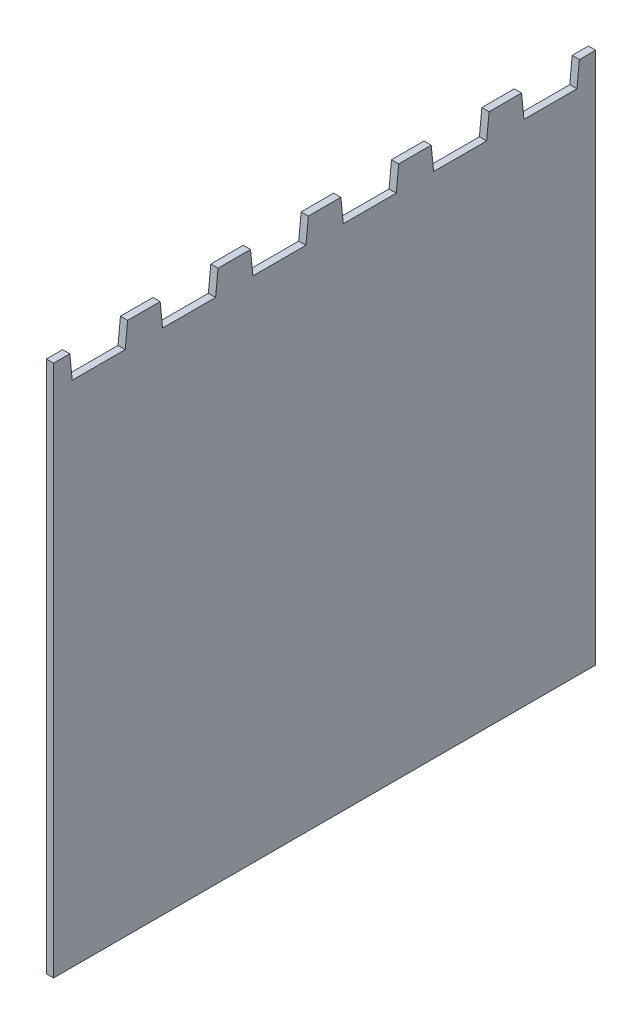
ISO-10303-21;
HEADER;
FILE_DESCRIPTION(('STEP AP214'),'2;1');
FILE_NAME('part.step','',(''),(''),'','','');
FILE_SCHEMA(('AUTOMOTIVE_DESIGN { 1 0 10303 214 1 1 1 1 }'));
ENDSEC;
DATA;
#1=APPLICATION_CONTEXT('core data for automotive mechanical design processes');
#2=APPLICATION_PROTOCOL_DEFINITION('international standard','automotive_design',2000,#1);
#3=PRODUCT_CONTEXT('',#1,'mechanical');
#4=PRODUCT('Part','Part','',(#3));
#5=PRODUCT_RELATED_PRODUCT_CATEGORY('part','',(#4));
#6=PRODUCT_DEFINITION_FORMATION('','',#4);
#7=PRODUCT_DEFINITION_CONTEXT('part definition',#1,'design');
#8=PRODUCT_DEFINITION('design','',#6,#7);
#9=PRODUCT_DEFINITION_SHAPE('','',#8);
#10=(LENGTH_UNIT() NAMED_UNIT(*) SI_UNIT(.MILLI.,.METRE.));
#11=(NAMED_UNIT(*) PLANE_ANGLE_UNIT() SI_UNIT($,.RADIAN.));
#12=(NAMED_UNIT(*) SI_UNIT($,.STERADIAN.) SOLID_ANGLE_UNIT());
#13=UNCERTAINTY_MEASURE_WITH_UNIT(LENGTH_MEASURE(1.E-05),#10,'distance_accuracy_value','');
#14=(GEOMETRIC_REPRESENTATION_CONTEXT(3) GLOBAL_UNCERTAINTY_ASSIGNED_CONTEXT((#13)) GLOBAL_UNIT_ASSIGNED_CONTEXT((#10,
#11,#12)) REPRESENTATION_CONTEXT('',''));
#15=CARTESIAN_POINT('',(0.,0.,0.));
#16=DIRECTION('',(0.,0.,1.));
#17=DIRECTION('',(1.,0.,0.));
#18=AXIS2_PLACEMENT_3D('',#15,#16,#17);
#19=CARTESIAN_POINT('',(3.,-103.,0.));
#20=DIRECTION('',(0.,1.,0.));
#21=DIRECTION('',(0.,0.,1.));
#22=AXIS2_PLACEMENT_3D('',#19,#20,#21);
#23=PLANE('',#22);
#24=DIRECTION('',(0.,0.,-1.));
#25=VECTOR('',#24,1.);
#26=CARTESIAN_POINT('',(0.,-103.,0.));
#27=LINE('',#26,#25);
#28=CARTESIAN_POINT('',(0.,-103.,206.25));
#29=VERTEX_POINT('',#28);
#30=CARTESIAN_POINT('',(0.,-103.,-18.75));
#31=VERTEX_POINT('',#30);
#32=EDGE_CURVE('E124',#29,#31,#27,.T.);
#33=ORIENTED_EDGE('',*,*,#32,.T.);
#34=DIRECTION('',(-1.,0.,0.));
#35=VECTOR('',#34,1.);
#36=CARTESIAN_POINT('',(3.,-103.,-18.75));
#37=LINE('',#36,#35);
#38=CARTESIAN_POINT('',(3.,-103.,-18.75));
#39=VERTEX_POINT('',#38);
#40=EDGE_CURVE('E11',#39,#31,#37,.T.);
#41=ORIENTED_EDGE('',*,*,#40,.F.);
#42=DIRECTION('',(0.,0.,-1.));
#43=VECTOR('',#42,1.);
#44=CARTESIAN_POINT('',(3.,-103.,0.));
#45=LINE('',#44,#43);
#46=CARTESIAN_POINT('',(3.,-103.,206.25));
#47=VERTEX_POINT('',#46);
#48=EDGE_CURVE('E143',#47,#39,#45,.T.);
#49=ORIENTED_EDGE('',*,*,#48,.F.);
#50=DIRECTION('',(-1.,0.,0.));
#51=VECTOR('',#50,1.);
#52=CARTESIAN_POINT('',(3.,-103.,206.25));
#53=LINE('',#52,#51);
#54=EDGE_CURVE('E174',#47,#29,#53,.T.);
#55=ORIENTED_EDGE('',*,*,#54,.T.);
#56=EDGE_LOOP('',(#33,#41,#49,#55));
#57=FACE_BOUND('',#56,.T.);
#58=ADVANCED_FACE('F35',(#57),#23,.F.);
#59=CARTESIAN_POINT('',(3.,0.,-18.75));
#60=DIRECTION('',(0.,0.,1.));
#61=DIRECTION('',(1.,0.,0.));
#62=AXIS2_PLACEMENT_3D('',#59,#60,#61);
#63=PLANE('',#62);
#64=DIRECTION('',(0.,1.,0.));
#65=VECTOR('',#64,1.);
#66=CARTESIAN_POINT('',(0.,0.,-18.75));
#67=LINE('',#66,#65);
#68=CARTESIAN_POINT('',(0.,118.,-18.75));
#69=VERTEX_POINT('',#68);
#70=EDGE_CURVE('E127',#31,#69,#67,.T.);
#71=ORIENTED_EDGE('',*,*,#70,.T.);
#72=DIRECTION('',(-1.,0.,0.));
#73=VECTOR('',#72,1.);
#74=CARTESIAN_POINT('',(3.,118.,-18.75));
#75=LINE('',#74,#73);
#76=CARTESIAN_POINT('',(3.,118.,-18.75));
#77=VERTEX_POINT('',#76);
#78=EDGE_CURVE('E43',#77,#69,#75,.T.);
#79=ORIENTED_EDGE('',*,*,#78,.F.);
#80=DIRECTION('',(0.,1.,0.));
#81=VECTOR('',#80,1.);
#82=CARTESIAN_POINT('',(3.,0.,-18.75));
#83=LINE('',#82,#81);
#84=EDGE_CURVE('E84',#39,#77,#83,.T.);
#85=ORIENTED_EDGE('',*,*,#84,.F.);
#86=ORIENTED_EDGE('',*,*,#40,.T.);
#87=EDGE_LOOP('',(#71,#79,#85,#86));
#88=FACE_BOUND('',#87,.T.);
#89=ADVANCED_FACE('F149',(#88),#63,.F.);
#90=CARTESIAN_POINT('',(3.,118.,0.));
#91=DIRECTION('',(0.,1.,0.));
#92=DIRECTION('',(0.,0.,1.));
#93=AXIS2_PLACEMENT_3D('',#90,#91,#92);
#94=PLANE('',#93);
#95=DIRECTION('',(0.,0.,-1.));
#96=VECTOR('',#95,1.);
#97=CARTESIAN_POINT('',(0.,118.,0.));
#98=LINE('',#97,#96);
#99=CARTESIAN_POINT('',(0.,118.,-12.));
#100=VERTEX_POINT('',#99);
#101=EDGE_CURVE('E131',#100,#69,#98,.T.);
#102=ORIENTED_EDGE('',*,*,#101,.F.);
#103=DIRECTION('',(-1.,0.,0.));
#104=VECTOR('',#103,1.);
#105=CARTESIAN_POINT('',(3.,118.,-12.));
#106=LINE('',#105,#104);
#107=CARTESIAN_POINT('',(3.,118.,-12.));
#108=VERTEX_POINT('',#107);
#109=EDGE_CURVE('E106',#108,#100,#106,.T.);
#110=ORIENTED_EDGE('',*,*,#109,.F.);
#111=DIRECTION('',(0.,0.,-1.));
#112=VECTOR('',#111,1.);
#113=CARTESIAN_POINT('',(3.,118.,0.));
#114=LINE('',#113,#112);
#115=EDGE_CURVE('E114',#108,#77,#114,.T.);
#116=ORIENTED_EDGE('',*,*,#115,.T.);
#117=ORIENTED_EDGE('',*,*,#78,.T.);
#118=EDGE_LOOP('',(#102,#110,#116,#117));
#119=FACE_BOUND('',#118,.T.);
#120=ADVANCED_FACE('F148',(#119),#94,.T.);
#121=CARTESIAN_POINT('',(3.,-0.0198019801980195,-0.198019801980195));
#122=DIRECTION('',(0.,0.0995037190209989,0.995037190209989));
#123=DIRECTION('',(0.,-0.995037190209989,0.0995037190209989));
#124=AXIS2_PLACEMENT_3D('',#121,#122,#123);
#125=PLANE('',#124);
#126=DIRECTION('',(0.,0.995037190209989,-0.0995037190209989));
#127=VECTOR('',#126,1.);
#128=CARTESIAN_POINT('',(0.,-0.0198019801980195,-0.198019801980195));
#129=LINE('',#128,#127);
#130=CARTESIAN_POINT('',(0.,108.,-11.));
#131=VERTEX_POINT('',#130);
#132=EDGE_CURVE('E102',#131,#100,#129,.T.);
#133=ORIENTED_EDGE('',*,*,#132,.F.);
#134=DIRECTION('',(-1.,0.,0.));
#135=VECTOR('',#134,1.);
#136=CARTESIAN_POINT('',(3.,108.,-11.));
#137=LINE('',#136,#135);
#138=CARTESIAN_POINT('',(3.,108.,-11.));
#139=VERTEX_POINT('',#138);
#140=EDGE_CURVE('E97',#139,#131,#137,.T.);
#141=ORIENTED_EDGE('',*,*,#140,.F.);
#142=DIRECTION('',(0.,0.995037190209989,-0.0995037190209989));
#143=VECTOR('',#142,1.);
#144=CARTESIAN_POINT('',(3.,-0.0198019801980195,-0.198019801980195));
#145=LINE('',#144,#143);
#146=EDGE_CURVE('E100',#139,#108,#145,.T.);
#147=ORIENTED_EDGE('',*,*,#146,.T.);
#148=ORIENTED_EDGE('',*,*,#109,.T.);
#149=EDGE_LOOP('',(#133,#141,#147,#148));
#150=FACE_BOUND('',#149,.T.);
#151=ADVANCED_FACE('F99',(#150),#125,.T.);
#152=CARTESIAN_POINT('',(3.,108.,0.));
#153=DIRECTION('',(0.,1.,0.));
#154=DIRECTION('',(0.,0.,1.));
#155=AXIS2_PLACEMENT_3D('',#152,#153,#154);
#156=PLANE('',#155);
#157=DIRECTION('',(0.,0.,-1.));
#158=VECTOR('',#157,1.);
#159=CARTESIAN_POINT('',(0.,108.,0.));
#160=LINE('',#159,#158);
#161=CARTESIAN_POINT('',(0.,108.,11.));
#162=VERTEX_POINT('',#161);
#163=EDGE_CURVE('E135',#162,#131,#160,.T.);
#164=ORIENTED_EDGE('',*,*,#163,.F.);
#165=DIRECTION('',(-1.,0.,0.));
#166=VECTOR('',#165,1.);
#167=CARTESIAN_POINT('',(3.,108.,11.));
#168=LINE('',#167,#166);
#169=CARTESIAN_POINT('',(3.,108.,11.));
#170=VERTEX_POINT('',#169);
#171=EDGE_CURVE('E72',#170,#162,#168,.T.);
#172=ORIENTED_EDGE('',*,*,#171,.F.);
#173=DIRECTION('',(0.,0.,-1.));
#174=VECTOR('',#173,1.);
#175=CARTESIAN_POINT('',(3.,108.,0.));
#176=LINE('',#175,#174);
#177=EDGE_CURVE('E112',#170,#139,#176,.T.);
#178=ORIENTED_EDGE('',*,*,#177,.T.);
#179=ORIENTED_EDGE('',*,*,#140,.T.);
#180=EDGE_LOOP('',(#164,#172,#178,#179));
#181=FACE_BOUND('',#180,.T.);
#182=ADVANCED_FACE('F116',(#181),#156,.T.);
#183=CARTESIAN_POINT('',(3.,-0.0198019801980129,0.198019801980127));
#184=DIRECTION('',(0.,0.0995037190209996,-0.995037190209989));
#185=DIRECTION('',(0.,0.995037190209989,0.0995037190209996));
#186=AXIS2_PLACEMENT_3D('',#183,#184,#185);
#187=PLANE('',#186);
#188=DIRECTION('',(0.,-0.995037190209989,-0.0995037190209996));
#189=VECTOR('',#188,1.);
#190=CARTESIAN_POINT('',(0.,-0.0198019801980129,0.198019801980127));
#191=LINE('',#190,#189);
#192=CARTESIAN_POINT('',(0.,118.,12.));
#193=VERTEX_POINT('',#192);
#194=EDGE_CURVE('E137',#193,#162,#191,.T.);
#195=ORIENTED_EDGE('',*,*,#194,.F.);
#196=DIRECTION('',(-1.,0.,0.));
#197=VECTOR('',#196,1.);
#198=CARTESIAN_POINT('',(3.,118.,12.));
#199=LINE('',#198,#197);
#200=CARTESIAN_POINT('',(3.,118.,12.));
#201=VERTEX_POINT('',#200);
#202=EDGE_CURVE('E51',#201,#193,#199,.T.);
#203=ORIENTED_EDGE('',*,*,#202,.F.);
#204=DIRECTION('',(0.,-0.995037190209989,-0.0995037190209996));
#205=VECTOR('',#204,1.);
#206=CARTESIAN_POINT('',(3.,-0.0198019801980129,0.198019801980127));
#207=LINE('',#206,#205);
#208=EDGE_CURVE('E117',#201,#170,#207,.T.);
#209=ORIENTED_EDGE('',*,*,#208,.T.);
#210=ORIENTED_EDGE('',*,*,#171,.T.);
#211=EDGE_LOOP('',(#195,#203,#209,#210));
#212=FACE_BOUND('',#211,.T.);
#213=ADVANCED_FACE('F155',(#212),#187,.T.);
#214=CARTESIAN_POINT('',(3.,118.,0.));
#215=DIRECTION('',(0.,1.,0.));
#216=DIRECTION('',(0.,0.,1.));
#217=AXIS2_PLACEMENT_3D('',#214,#215,#216);
#218=PLANE('',#217);
#219=DIRECTION('',(0.,0.,-1.));
#220=VECTOR('',#219,1.);
#221=CARTESIAN_POINT('',(0.,118.,0.));
#222=LINE('',#221,#220);
#223=CARTESIAN_POINT('',(0.,118.,25.5));
#224=VERTEX_POINT('',#223);
#225=EDGE_CURVE('E140',#224,#193,#222,.T.);
#226=ORIENTED_EDGE('',*,*,#225,.F.);
#227=DIRECTION('',(-1.,0.,0.));
#228=VECTOR('',#227,1.);
#229=CARTESIAN_POINT('',(3.,118.,25.5));
#230=LINE('',#229,#228);
#231=CARTESIAN_POINT('',(3.,118.,25.5));
#232=VERTEX_POINT('',#231);
#233=EDGE_CURVE('E128',#232,#224,#230,.T.);
#234=ORIENTED_EDGE('',*,*,#233,.F.);
#235=DIRECTION('',(0.,0.,-1.));
#236=VECTOR('',#235,1.);
#237=CARTESIAN_POINT('',(3.,118.,0.));
#238=LINE('',#237,#236);
#239=EDGE_CURVE('E119',#232,#201,#238,.T.);
#240=ORIENTED_EDGE('',*,*,#239,.T.);
#241=ORIENTED_EDGE('',*,*,#202,.T.);
#242=EDGE_LOOP('',(#226,#234,#240,#241));
#243=FACE_BOUND('',#242,.T.);
#244=ADVANCED_FACE('F157',(#243),#218,.T.);
#245=CARTESIAN_POINT('',(3.,0.,0.));
#246=DIRECTION('',(1.,0.,0.));
#247=DIRECTION('',(0.,0.,-1.));
#248=AXIS2_PLACEMENT_3D('',#245,#246,#247);
#249=PLANE('',#248);
#250=ORIENTED_EDGE('',*,*,#48,.T.);
#251=ORIENTED_EDGE('',*,*,#84,.T.);
#252=ORIENTED_EDGE('',*,*,#115,.F.);
#253=ORIENTED_EDGE('',*,*,#146,.F.);
#254=ORIENTED_EDGE('',*,*,#177,.F.);
#255=ORIENTED_EDGE('',*,*,#208,.F.);
#256=ORIENTED_EDGE('',*,*,#239,.F.);
#257=DIRECTION('',(0.,0.995037190209989,-0.0995037190209989));
#258=VECTOR('',#257,1.);
#259=CARTESIAN_POINT('',(3.,-0.0198019801980195,37.3019801980198));
#260=LINE('',#259,#258);
#261=CARTESIAN_POINT('',(3.,108.,26.5));
#262=VERTEX_POINT('',#261);
#263=EDGE_CURVE('E307',#262,#232,#260,.T.);
#264=ORIENTED_EDGE('',*,*,#263,.F.);
#265=DIRECTION('',(0.,0.,-1.));
#266=VECTOR('',#265,1.);
#267=CARTESIAN_POINT('',(3.,108.,37.5));
#268=LINE('',#267,#266);
#269=CARTESIAN_POINT('',(3.,108.,48.5));
#270=VERTEX_POINT('',#269);
#271=EDGE_CURVE('E310',#270,#262,#268,.T.);
#272=ORIENTED_EDGE('',*,*,#271,.F.);
#273=DIRECTION('',(0.,-0.995037190209989,-0.0995037190209996));
#274=VECTOR('',#273,1.);
#275=CARTESIAN_POINT('',(3.,-0.0198019801980129,37.6980198019801));
#276=LINE('',#275,#274);
#277=CARTESIAN_POINT('',(3.,118.,49.5));
#278=VERTEX_POINT('',#277);
#279=EDGE_CURVE('E446',#278,#270,#276,.T.);
#280=ORIENTED_EDGE('',*,*,#279,.F.);
#281=DIRECTION('',(0.,0.,-1.));
#282=VECTOR('',#281,1.);
#283=CARTESIAN_POINT('',(3.,118.,37.5));
#284=LINE('',#283,#282);
#285=CARTESIAN_POINT('',(3.,118.,63.));
#286=VERTEX_POINT('',#285);
#287=EDGE_CURVE('E294',#286,#278,#284,.T.);
#288=ORIENTED_EDGE('',*,*,#287,.F.);
#289=DIRECTION('',(0.,0.995037190209989,-0.0995037190209989));
#290=VECTOR('',#289,1.);
#291=CARTESIAN_POINT('',(3.,-0.0198019801980195,74.8019801980198));
#292=LINE('',#291,#290);
#293=CARTESIAN_POINT('',(3.,108.,64.));
#294=VERTEX_POINT('',#293);
#295=EDGE_CURVE('E414',#294,#286,#292,.T.);
#296=ORIENTED_EDGE('',*,*,#295,.F.);
#297=DIRECTION('',(0.,0.,-1.));
#298=VECTOR('',#297,1.);
#299=CARTESIAN_POINT('',(3.,108.,75.));
#300=LINE('',#299,#298);
#301=CARTESIAN_POINT('',(3.,108.,86.));
#302=VERTEX_POINT('',#301);
#303=EDGE_CURVE('E417',#302,#294,#300,.T.);
#304=ORIENTED_EDGE('',*,*,#303,.F.);
#305=DIRECTION('',(0.,-0.995037190209989,-0.0995037190209996));
#306=VECTOR('',#305,1.);
#307=CARTESIAN_POINT('',(3.,-0.0198019801980129,75.1980198019801));
#308=LINE('',#307,#306);
#309=CARTESIAN_POINT('',(3.,118.,87.));
#310=VERTEX_POINT('',#309);
#311=EDGE_CURVE('E421',#310,#302,#308,.T.);
#312=ORIENTED_EDGE('',*,*,#311,.F.);
#313=DIRECTION('',(0.,0.,-1.));
#314=VECTOR('',#313,1.);
#315=CARTESIAN_POINT('',(3.,118.,75.));
#316=LINE('',#315,#314);
#317=CARTESIAN_POINT('',(3.,118.,100.5));
#318=VERTEX_POINT('',#317);
#319=EDGE_CURVE('E424',#318,#310,#316,.T.);
#320=ORIENTED_EDGE('',*,*,#319,.F.);
#321=DIRECTION('',(0.,0.995037190209989,-0.0995037190209989));
#322=VECTOR('',#321,1.);
#323=CARTESIAN_POINT('',(3.,-0.0198019801980195,112.30198019802));
#324=LINE('',#323,#322);
#325=CARTESIAN_POINT('',(3.,108.,101.5));
#326=VERTEX_POINT('',#325);
#327=EDGE_CURVE('E382',#326,#318,#324,.T.);
#328=ORIENTED_EDGE('',*,*,#327,.F.);
#329=DIRECTION('',(0.,0.,-1.));
#330=VECTOR('',#329,1.);
#331=CARTESIAN_POINT('',(3.,108.,112.5));
#332=LINE('',#331,#330);
#333=CARTESIAN_POINT('',(3.,108.,123.5));
#334=VERTEX_POINT('',#333);
#335=EDGE_CURVE('E385',#334,#326,#332,.T.);
#336=ORIENTED_EDGE('',*,*,#335,.F.);
#337=DIRECTION('',(0.,-0.995037190209989,-0.0995037190209996));
#338=VECTOR('',#337,1.);
#339=CARTESIAN_POINT('',(3.,-0.0198019801980129,112.69801980198));
#340=LINE('',#339,#338);
#341=CARTESIAN_POINT('',(3.,118.,124.5));
#342=VERTEX_POINT('',#341);
#343=EDGE_CURVE('E389',#342,#334,#340,.T.);
#344=ORIENTED_EDGE('',*,*,#343,.F.);
#345=DIRECTION('',(0.,0.,-1.));
#346=VECTOR('',#345,1.);
#347=CARTESIAN_POINT('',(3.,118.,112.5));
#348=LINE('',#347,#346);
#349=CARTESIAN_POINT('',(3.,118.,138.));
#350=VERTEX_POINT('',#349);
#351=EDGE_CURVE('E392',#350,#342,#348,.T.);
#352=ORIENTED_EDGE('',*,*,#351,.F.);
#353=DIRECTION('',(0.,0.995037190209989,-0.0995037190209989));
#354=VECTOR('',#353,1.);
#355=CARTESIAN_POINT('',(3.,-0.0198019801980195,149.80198019802));
#356=LINE('',#355,#354);
#357=CARTESIAN_POINT('',(3.,108.,139.));
#358=VERTEX_POINT('',#357);
#359=EDGE_CURVE('E349',#358,#350,#356,.T.);
#360=ORIENTED_EDGE('',*,*,#359,.F.);
#361=DIRECTION('',(0.,0.,-1.));
#362=VECTOR('',#361,1.);
#363=CARTESIAN_POINT('',(3.,108.,150.));
#364=LINE('',#363,#362);
#365=CARTESIAN_POINT('',(3.,108.,161.));
#366=VERTEX_POINT('',#365);
#367=EDGE_CURVE('E352',#366,#358,#364,.T.);
#368=ORIENTED_EDGE('',*,*,#367,.F.);
#369=DIRECTION('',(0.,-0.995037190209989,-0.0995037190209996));
#370=VECTOR('',#369,1.);
#371=CARTESIAN_POINT('',(3.,-0.0198019801980129,150.19801980198));
#372=LINE('',#371,#370);
#373=CARTESIAN_POINT('',(3.,118.,162.));
#374=VERTEX_POINT('',#373);
#375=EDGE_CURVE('E356',#374,#366,#372,.T.);
#376=ORIENTED_EDGE('',*,*,#375,.F.);
#377=DIRECTION('',(0.,0.,-1.));
#378=VECTOR('',#377,1.);
#379=CARTESIAN_POINT('',(3.,118.,150.));
#380=LINE('',#379,#378);
#381=CARTESIAN_POINT('',(3.,118.,175.5));
#382=VERTEX_POINT('',#381);
#383=EDGE_CURVE('E359',#382,#374,#380,.T.);
#384=ORIENTED_EDGE('',*,*,#383,.F.);
#385=DIRECTION('',(0.,0.995037190209989,-0.0995037190209989));
#386=VECTOR('',#385,1.);
#387=CARTESIAN_POINT('',(3.,-0.0198019801980195,187.30198019802));
#388=LINE('',#387,#386);
#389=CARTESIAN_POINT('',(3.,108.,176.5));
#390=VERTEX_POINT('',#389);
#391=EDGE_CURVE('E508',#390,#382,#388,.T.);
#392=ORIENTED_EDGE('',*,*,#391,.F.);
#393=DIRECTION('',(0.,0.,-1.));
#394=VECTOR('',#393,1.);
#395=CARTESIAN_POINT('',(3.,108.,187.5));
#396=LINE('',#395,#394);
#397=CARTESIAN_POINT('',(3.,108.,198.5));
#398=VERTEX_POINT('',#397);
#399=EDGE_CURVE('E512',#398,#390,#396,.T.);
#400=ORIENTED_EDGE('',*,*,#399,.F.);
#401=DIRECTION('',(0.,-0.995037190209989,-0.0995037190209996));
#402=VECTOR('',#401,1.);
#403=CARTESIAN_POINT('',(3.,-0.0198019801980129,187.69801980198));
#404=LINE('',#403,#402);
#405=CARTESIAN_POINT('',(3.,118.,199.5));
#406=VERTEX_POINT('',#405);
#407=EDGE_CURVE('E514',#406,#398,#404,.T.);
#408=ORIENTED_EDGE('',*,*,#407,.F.);
#409=DIRECTION('',(0.,0.,-1.));
#410=VECTOR('',#409,1.);
#411=CARTESIAN_POINT('',(3.,118.,187.5));
#412=LINE('',#411,#410);
#413=CARTESIAN_POINT('',(3.,118.,206.25));
#414=VERTEX_POINT('',#413);
#415=EDGE_CURVE('E332',#414,#406,#412,.T.);
#416=ORIENTED_EDGE('',*,*,#415,.F.);
#417=DIRECTION('',(0.,1.,0.));
#418=VECTOR('',#417,1.);
#419=CARTESIAN_POINT('',(3.,0.,206.25));
#420=LINE('',#419,#418);
#421=EDGE_CURVE('E323',#47,#414,#420,.T.);
#422=ORIENTED_EDGE('',*,*,#421,.F.);
#423=EDGE_LOOP('',(#250,#251,#252,#253,#254,#255,#256,#264,#272,#280,#288,#296,#304,#312,#320,
#328,#336,#344,#352,#360,#368,#376,#384,#392,#400,#408,#416,#422));
#424=FACE_BOUND('',#423,.T.);
#425=ADVANCED_FACE('F111',(#424),#249,.T.);
#426=CARTESIAN_POINT('',(0.,0.,0.));
#427=DIRECTION('',(1.,0.,0.));
#428=DIRECTION('',(0.,0.,-1.));
#429=AXIS2_PLACEMENT_3D('',#426,#427,#428);
#430=PLANE('',#429);
#431=ORIENTED_EDGE('',*,*,#32,.F.);
#432=DIRECTION('',(0.,1.,0.));
#433=VECTOR('',#432,1.);
#434=CARTESIAN_POINT('',(0.,0.,206.25));
#435=LINE('',#434,#433);
#436=CARTESIAN_POINT('',(0.,118.,206.25));
#437=VERTEX_POINT('',#436);
#438=EDGE_CURVE('E179',#29,#437,#435,.T.);
#439=ORIENTED_EDGE('',*,*,#438,.T.);
#440=DIRECTION('',(0.,0.,-1.));
#441=VECTOR('',#440,1.);
#442=CARTESIAN_POINT('',(0.,118.,187.5));
#443=LINE('',#442,#441);
#444=CARTESIAN_POINT('',(0.,118.,199.5));
#445=VERTEX_POINT('',#444);
#446=EDGE_CURVE('E516',#437,#445,#443,.T.);
#447=ORIENTED_EDGE('',*,*,#446,.T.);
#448=DIRECTION('',(0.,-0.995037190209989,-0.0995037190209996));
#449=VECTOR('',#448,1.);
#450=CARTESIAN_POINT('',(0.,-0.0198019801980129,187.69801980198));
#451=LINE('',#450,#449);
#452=CARTESIAN_POINT('',(0.,108.,198.5));
#453=VERTEX_POINT('',#452);
#454=EDGE_CURVE('E527',#445,#453,#451,.T.);
#455=ORIENTED_EDGE('',*,*,#454,.T.);
#456=DIRECTION('',(0.,0.,-1.));
#457=VECTOR('',#456,1.);
#458=CARTESIAN_POINT('',(0.,108.,187.5));
#459=LINE('',#458,#457);
#460=CARTESIAN_POINT('',(0.,108.,176.5));
#461=VERTEX_POINT('',#460);
#462=EDGE_CURVE('E524',#453,#461,#459,.T.);
#463=ORIENTED_EDGE('',*,*,#462,.T.);
#464=DIRECTION('',(0.,0.995037190209989,-0.0995037190209989));
#465=VECTOR('',#464,1.);
#466=CARTESIAN_POINT('',(0.,-0.0198019801980195,187.30198019802));
#467=LINE('',#466,#465);
#468=CARTESIAN_POINT('',(0.,118.,175.5));
#469=VERTEX_POINT('',#468);
#470=EDGE_CURVE('E522',#461,#469,#467,.T.);
#471=ORIENTED_EDGE('',*,*,#470,.T.);
#472=DIRECTION('',(0.,0.,-1.));
#473=VECTOR('',#472,1.);
#474=CARTESIAN_POINT('',(0.,118.,150.));
#475=LINE('',#474,#473);
#476=CARTESIAN_POINT('',(0.,118.,162.));
#477=VERTEX_POINT('',#476);
#478=EDGE_CURVE('E353',#469,#477,#475,.T.);
#479=ORIENTED_EDGE('',*,*,#478,.T.);
#480=DIRECTION('',(0.,-0.995037190209989,-0.0995037190209996));
#481=VECTOR('',#480,1.);
#482=CARTESIAN_POINT('',(0.,-0.0198019801980129,150.19801980198));
#483=LINE('',#482,#481);
#484=CARTESIAN_POINT('',(0.,108.,161.));
#485=VERTEX_POINT('',#484);
#486=EDGE_CURVE('E368',#477,#485,#483,.T.);
#487=ORIENTED_EDGE('',*,*,#486,.T.);
#488=DIRECTION('',(0.,0.,-1.));
#489=VECTOR('',#488,1.);
#490=CARTESIAN_POINT('',(0.,108.,150.));
#491=LINE('',#490,#489);
#492=CARTESIAN_POINT('',(0.,108.,139.));
#493=VERTEX_POINT('',#492);
#494=EDGE_CURVE('E365',#485,#493,#491,.T.);
#495=ORIENTED_EDGE('',*,*,#494,.T.);
#496=DIRECTION('',(0.,0.995037190209989,-0.0995037190209989));
#497=VECTOR('',#496,1.);
#498=CARTESIAN_POINT('',(0.,-0.0198019801980195,149.80198019802));
#499=LINE('',#498,#497);
#500=CARTESIAN_POINT('',(0.,118.,138.));
#501=VERTEX_POINT('',#500);
#502=EDGE_CURVE('E348',#493,#501,#499,.T.);
#503=ORIENTED_EDGE('',*,*,#502,.T.);
#504=DIRECTION('',(0.,0.,-1.));
#505=VECTOR('',#504,1.);
#506=CARTESIAN_POINT('',(0.,118.,112.5));
#507=LINE('',#506,#505);
#508=CARTESIAN_POINT('',(0.,118.,124.5));
#509=VERTEX_POINT('',#508);
#510=EDGE_CURVE('E386',#501,#509,#507,.T.);
#511=ORIENTED_EDGE('',*,*,#510,.T.);
#512=DIRECTION('',(0.,-0.995037190209989,-0.0995037190209996));
#513=VECTOR('',#512,1.);
#514=CARTESIAN_POINT('',(0.,-0.0198019801980129,112.69801980198));
#515=LINE('',#514,#513);
#516=CARTESIAN_POINT('',(0.,108.,123.5));
#517=VERTEX_POINT('',#516);
#518=EDGE_CURVE('E401',#509,#517,#515,.T.);
#519=ORIENTED_EDGE('',*,*,#518,.T.);
#520=DIRECTION('',(0.,0.,-1.));
#521=VECTOR('',#520,1.);
#522=CARTESIAN_POINT('',(0.,108.,112.5));
#523=LINE('',#522,#521);
#524=CARTESIAN_POINT('',(0.,108.,101.5));
#525=VERTEX_POINT('',#524);
#526=EDGE_CURVE('E398',#517,#525,#523,.T.);
#527=ORIENTED_EDGE('',*,*,#526,.T.);
#528=DIRECTION('',(0.,0.995037190209989,-0.0995037190209989));
#529=VECTOR('',#528,1.);
#530=CARTESIAN_POINT('',(0.,-0.0198019801980195,112.30198019802));
#531=LINE('',#530,#529);
#532=CARTESIAN_POINT('',(0.,118.,100.5));
#533=VERTEX_POINT('',#532);
#534=EDGE_CURVE('E381',#525,#533,#531,.T.);
#535=ORIENTED_EDGE('',*,*,#534,.T.);
#536=DIRECTION('',(0.,0.,-1.));
#537=VECTOR('',#536,1.);
#538=CARTESIAN_POINT('',(0.,118.,75.));
#539=LINE('',#538,#537);
#540=CARTESIAN_POINT('',(0.,118.,87.));
#541=VERTEX_POINT('',#540);
#542=EDGE_CURVE('E418',#533,#541,#539,.T.);
#543=ORIENTED_EDGE('',*,*,#542,.T.);
#544=DIRECTION('',(0.,-0.995037190209989,-0.0995037190209996));
#545=VECTOR('',#544,1.);
#546=CARTESIAN_POINT('',(0.,-0.0198019801980129,75.1980198019801));
#547=LINE('',#546,#545);
#548=CARTESIAN_POINT('',(0.,108.,86.));
#549=VERTEX_POINT('',#548);
#550=EDGE_CURVE('E431',#541,#549,#547,.T.);
#551=ORIENTED_EDGE('',*,*,#550,.T.);
#552=DIRECTION('',(0.,0.,-1.));
#553=VECTOR('',#552,1.);
#554=CARTESIAN_POINT('',(0.,108.,75.));
#555=LINE('',#554,#553);
#556=CARTESIAN_POINT('',(0.,108.,64.));
#557=VERTEX_POINT('',#556);
#558=EDGE_CURVE('E429',#549,#557,#555,.T.);
#559=ORIENTED_EDGE('',*,*,#558,.T.);
#560=DIRECTION('',(0.,0.995037190209989,-0.0995037190209989));
#561=VECTOR('',#560,1.);
#562=CARTESIAN_POINT('',(0.,-0.0198019801980195,74.8019801980198));
#563=LINE('',#562,#561);
#564=CARTESIAN_POINT('',(0.,118.,63.));
#565=VERTEX_POINT('',#564);
#566=EDGE_CURVE('E306',#557,#565,#563,.T.);
#567=ORIENTED_EDGE('',*,*,#566,.T.);
#568=DIRECTION('',(0.,0.,-1.));
#569=VECTOR('',#568,1.);
#570=CARTESIAN_POINT('',(0.,118.,37.5));
#571=LINE('',#570,#569);
#572=CARTESIAN_POINT('',(0.,118.,49.5));
#573=VERTEX_POINT('',#572);
#574=EDGE_CURVE('E292',#565,#573,#571,.T.);
#575=ORIENTED_EDGE('',*,*,#574,.T.);
#576=DIRECTION('',(0.,-0.995037190209989,-0.0995037190209996));
#577=VECTOR('',#576,1.);
#578=CARTESIAN_POINT('',(0.,-0.0198019801980129,37.6980198019801));
#579=LINE('',#578,#577);
#580=CARTESIAN_POINT('',(0.,108.,48.5));
#581=VERTEX_POINT('',#580);
#582=EDGE_CURVE('E298',#573,#581,#579,.T.);
#583=ORIENTED_EDGE('',*,*,#582,.T.);
#584=DIRECTION('',(0.,0.,-1.));
#585=VECTOR('',#584,1.);
#586=CARTESIAN_POINT('',(0.,108.,37.5));
#587=LINE('',#586,#585);
#588=CARTESIAN_POINT('',(0.,108.,26.5));
#589=VERTEX_POINT('',#588);
#590=EDGE_CURVE('E301',#581,#589,#587,.T.);
#591=ORIENTED_EDGE('',*,*,#590,.T.);
#592=DIRECTION('',(0.,0.995037190209989,-0.0995037190209989));
#593=VECTOR('',#592,1.);
#594=CARTESIAN_POINT('',(0.,-0.0198019801980195,37.3019801980198));
#595=LINE('',#594,#593);
#596=EDGE_CURVE('E442',#589,#224,#595,.T.);
#597=ORIENTED_EDGE('',*,*,#596,.T.);
#598=ORIENTED_EDGE('',*,*,#225,.T.);
#599=ORIENTED_EDGE('',*,*,#194,.T.);
#600=ORIENTED_EDGE('',*,*,#163,.T.);
#601=ORIENTED_EDGE('',*,*,#132,.T.);
#602=ORIENTED_EDGE('',*,*,#101,.T.);
#603=ORIENTED_EDGE('',*,*,#70,.F.);
#604=EDGE_LOOP('',(#431,#439,#447,#455,#463,#471,#479,#487,#495,#503,#511,#519,#527,#535,#543,
#551,#559,#567,#575,#583,#591,#597,#598,#599,#600,#601,#602,#603));
#605=FACE_BOUND('',#604,.T.);
#606=ADVANCED_FACE('F153',(#605),#430,.F.);
#607=CARTESIAN_POINT('',(3.,-0.0198019801980195,37.3019801980198));
#608=DIRECTION('',(0.,0.0995037190209989,0.995037190209989));
#609=DIRECTION('',(0.,-0.995037190209989,0.0995037190209989));
#610=AXIS2_PLACEMENT_3D('',#607,#608,#609);
#611=PLANE('',#610);
#612=ORIENTED_EDGE('',*,*,#596,.F.);
#613=DIRECTION('',(-1.,0.,0.));
#614=VECTOR('',#613,1.);
#615=CARTESIAN_POINT('',(3.,108.,26.5));
#616=LINE('',#615,#614);
#617=EDGE_CURVE('E315',#262,#589,#616,.T.);
#618=ORIENTED_EDGE('',*,*,#617,.F.);
#619=ORIENTED_EDGE('',*,*,#263,.T.);
#620=ORIENTED_EDGE('',*,*,#233,.T.);
#621=EDGE_LOOP('',(#612,#618,#619,#620));
#622=FACE_BOUND('',#621,.T.);
#623=ADVANCED_FACE('F455',(#622),#611,.T.);
#624=CARTESIAN_POINT('',(3.,108.,37.5));
#625=DIRECTION('',(0.,1.,0.));
#626=DIRECTION('',(0.,0.,1.));
#627=AXIS2_PLACEMENT_3D('',#624,#625,#626);
#628=PLANE('',#627);
#629=ORIENTED_EDGE('',*,*,#590,.F.);
#630=DIRECTION('',(-1.,0.,0.));
#631=VECTOR('',#630,1.);
#632=CARTESIAN_POINT('',(3.,108.,48.5));
#633=LINE('',#632,#631);
#634=EDGE_CURVE('E283',#270,#581,#633,.T.);
#635=ORIENTED_EDGE('',*,*,#634,.F.);
#636=ORIENTED_EDGE('',*,*,#271,.T.);
#637=ORIENTED_EDGE('',*,*,#617,.T.);
#638=EDGE_LOOP('',(#629,#635,#636,#637));
#639=FACE_BOUND('',#638,.T.);
#640=ADVANCED_FACE('F451',(#639),#628,.T.);
#641=CARTESIAN_POINT('',(3.,-0.0198019801980129,37.6980198019801));
#642=DIRECTION('',(0.,0.0995037190209996,-0.995037190209989));
#643=DIRECTION('',(0.,0.995037190209989,0.0995037190209996));
#644=AXIS2_PLACEMENT_3D('',#641,#642,#643);
#645=PLANE('',#644);
#646=ORIENTED_EDGE('',*,*,#582,.F.);
#647=DIRECTION('',(-1.,0.,0.));
#648=VECTOR('',#647,1.);
#649=CARTESIAN_POINT('',(3.,118.,49.5));
#650=LINE('',#649,#648);
#651=EDGE_CURVE('E288',#278,#573,#650,.T.);
#652=ORIENTED_EDGE('',*,*,#651,.F.);
#653=ORIENTED_EDGE('',*,*,#279,.T.);
#654=ORIENTED_EDGE('',*,*,#634,.T.);
#655=EDGE_LOOP('',(#646,#652,#653,#654));
#656=FACE_BOUND('',#655,.T.);
#657=ADVANCED_FACE('F299',(#656),#645,.T.);
#658=CARTESIAN_POINT('',(3.,118.,37.5));
#659=DIRECTION('',(0.,1.,0.));
#660=DIRECTION('',(0.,0.,1.));
#661=AXIS2_PLACEMENT_3D('',#658,#659,#660);
#662=PLANE('',#661);
#663=ORIENTED_EDGE('',*,*,#574,.F.);
#664=DIRECTION('',(-1.,0.,0.));
#665=VECTOR('',#664,1.);
#666=CARTESIAN_POINT('',(3.,118.,63.));
#667=LINE('',#666,#665);
#668=EDGE_CURVE('E441',#286,#565,#667,.T.);
#669=ORIENTED_EDGE('',*,*,#668,.F.);
#670=ORIENTED_EDGE('',*,*,#287,.T.);
#671=ORIENTED_EDGE('',*,*,#651,.T.);
#672=EDGE_LOOP('',(#663,#669,#670,#671));
#673=FACE_BOUND('',#672,.T.);
#674=ADVANCED_FACE('F289',(#673),#662,.T.);
#675=CARTESIAN_POINT('',(3.,-0.0198019801980195,74.8019801980198));
#676=DIRECTION('',(0.,0.0995037190209989,0.995037190209989));
#677=DIRECTION('',(0.,-0.995037190209989,0.0995037190209989));
#678=AXIS2_PLACEMENT_3D('',#675,#676,#677);
#679=PLANE('',#678);
#680=ORIENTED_EDGE('',*,*,#566,.F.);
#681=DIRECTION('',(-1.,0.,0.));
#682=VECTOR('',#681,1.);
#683=CARTESIAN_POINT('',(3.,108.,64.));
#684=LINE('',#683,#682);
#685=EDGE_CURVE('E439',#294,#557,#684,.T.);
#686=ORIENTED_EDGE('',*,*,#685,.F.);
#687=ORIENTED_EDGE('',*,*,#295,.T.);
#688=ORIENTED_EDGE('',*,*,#668,.T.);
#689=EDGE_LOOP('',(#680,#686,#687,#688));
#690=FACE_BOUND('',#689,.T.);
#691=ADVANCED_FACE('F460',(#690),#679,.T.);
#692=CARTESIAN_POINT('',(3.,108.,75.));
#693=DIRECTION('',(0.,1.,0.));
#694=DIRECTION('',(0.,0.,1.));
#695=AXIS2_PLACEMENT_3D('',#692,#693,#694);
#696=PLANE('',#695);
#697=ORIENTED_EDGE('',*,*,#558,.F.);
#698=DIRECTION('',(-1.,0.,0.));
#699=VECTOR('',#698,1.);
#700=CARTESIAN_POINT('',(3.,108.,86.));
#701=LINE('',#700,#699);
#702=EDGE_CURVE('E437',#302,#549,#701,.T.);
#703=ORIENTED_EDGE('',*,*,#702,.F.);
#704=ORIENTED_EDGE('',*,*,#303,.T.);
#705=ORIENTED_EDGE('',*,*,#685,.T.);
#706=EDGE_LOOP('',(#697,#703,#704,#705));
#707=FACE_BOUND('',#706,.T.);
#708=ADVANCED_FACE('F463',(#707),#696,.T.);
#709=CARTESIAN_POINT('',(3.,-0.0198019801980129,75.1980198019801));
#710=DIRECTION('',(0.,0.0995037190209996,-0.995037190209989));
#711=DIRECTION('',(0.,0.995037190209989,0.0995037190209996));
#712=AXIS2_PLACEMENT_3D('',#709,#710,#711);
#713=PLANE('',#712);
#714=ORIENTED_EDGE('',*,*,#550,.F.);
#715=DIRECTION('',(-1.,0.,0.));
#716=VECTOR('',#715,1.);
#717=CARTESIAN_POINT('',(3.,118.,87.));
#718=LINE('',#717,#716);
#719=EDGE_CURVE('E427',#310,#541,#718,.T.);
#720=ORIENTED_EDGE('',*,*,#719,.F.);
#721=ORIENTED_EDGE('',*,*,#311,.T.);
#722=ORIENTED_EDGE('',*,*,#702,.T.);
#723=EDGE_LOOP('',(#714,#720,#721,#722));
#724=FACE_BOUND('',#723,.T.);
#725=ADVANCED_FACE('F467',(#724),#713,.T.);
#726=CARTESIAN_POINT('',(3.,118.,75.));
#727=DIRECTION('',(0.,1.,0.));
#728=DIRECTION('',(0.,0.,1.));
#729=AXIS2_PLACEMENT_3D('',#726,#727,#728);
#730=PLANE('',#729);
#731=ORIENTED_EDGE('',*,*,#542,.F.);
#732=DIRECTION('',(-1.,0.,0.));
#733=VECTOR('',#732,1.);
#734=CARTESIAN_POINT('',(3.,118.,100.5));
#735=LINE('',#734,#733);
#736=EDGE_CURVE('E411',#318,#533,#735,.T.);
#737=ORIENTED_EDGE('',*,*,#736,.F.);
#738=ORIENTED_EDGE('',*,*,#319,.T.);
#739=ORIENTED_EDGE('',*,*,#719,.T.);
#740=EDGE_LOOP('',(#731,#737,#738,#739));
#741=FACE_BOUND('',#740,.T.);
#742=ADVANCED_FACE('F469',(#741),#730,.T.);
#743=CARTESIAN_POINT('',(3.,-0.0198019801980195,112.30198019802));
#744=DIRECTION('',(0.,0.0995037190209989,0.995037190209989));
#745=DIRECTION('',(0.,-0.995037190209989,0.0995037190209989));
#746=AXIS2_PLACEMENT_3D('',#743,#744,#745);
#747=PLANE('',#746);
#748=ORIENTED_EDGE('',*,*,#534,.F.);
#749=DIRECTION('',(-1.,0.,0.));
#750=VECTOR('',#749,1.);
#751=CARTESIAN_POINT('',(3.,108.,101.5));
#752=LINE('',#751,#750);
#753=EDGE_CURVE('E409',#326,#525,#752,.T.);
#754=ORIENTED_EDGE('',*,*,#753,.F.);
#755=ORIENTED_EDGE('',*,*,#327,.T.);
#756=ORIENTED_EDGE('',*,*,#736,.T.);
#757=EDGE_LOOP('',(#748,#754,#755,#756));
#758=FACE_BOUND('',#757,.T.);
#759=ADVANCED_FACE('F553',(#758),#747,.T.);
#760=CARTESIAN_POINT('',(3.,108.,112.5));
#761=DIRECTION('',(0.,1.,0.));
#762=DIRECTION('',(0.,0.,1.));
#763=AXIS2_PLACEMENT_3D('',#760,#761,#762);
#764=PLANE('',#763);
#765=ORIENTED_EDGE('',*,*,#526,.F.);
#766=DIRECTION('',(-1.,0.,0.));
#767=VECTOR('',#766,1.);
#768=CARTESIAN_POINT('',(3.,108.,123.5));
#769=LINE('',#768,#767);
#770=EDGE_CURVE('E407',#334,#517,#769,.T.);
#771=ORIENTED_EDGE('',*,*,#770,.F.);
#772=ORIENTED_EDGE('',*,*,#335,.T.);
#773=ORIENTED_EDGE('',*,*,#753,.T.);
#774=EDGE_LOOP('',(#765,#771,#772,#773));
#775=FACE_BOUND('',#774,.T.);
#776=ADVANCED_FACE('F477',(#775),#764,.T.);
#777=CARTESIAN_POINT('',(3.,-0.0198019801980129,112.69801980198));
#778=DIRECTION('',(0.,0.0995037190209996,-0.995037190209989));
#779=DIRECTION('',(0.,0.995037190209989,0.0995037190209996));
#780=AXIS2_PLACEMENT_3D('',#777,#778,#779);
#781=PLANE('',#780);
#782=ORIENTED_EDGE('',*,*,#518,.F.);
#783=DIRECTION('',(-1.,0.,0.));
#784=VECTOR('',#783,1.);
#785=CARTESIAN_POINT('',(3.,118.,124.5));
#786=LINE('',#785,#784);
#787=EDGE_CURVE('E395',#342,#509,#786,.T.);
#788=ORIENTED_EDGE('',*,*,#787,.F.);
#789=ORIENTED_EDGE('',*,*,#343,.T.);
#790=ORIENTED_EDGE('',*,*,#770,.T.);
#791=EDGE_LOOP('',(#782,#788,#789,#790));
#792=FACE_BOUND('',#791,.T.);
#793=ADVANCED_FACE('F481',(#792),#781,.T.);
#794=CARTESIAN_POINT('',(3.,118.,112.5));
#795=DIRECTION('',(0.,1.,0.));
#796=DIRECTION('',(0.,0.,1.));
#797=AXIS2_PLACEMENT_3D('',#794,#795,#796);
#798=PLANE('',#797);
#799=ORIENTED_EDGE('',*,*,#510,.F.);
#800=DIRECTION('',(-1.,0.,0.));
#801=VECTOR('',#800,1.);
#802=CARTESIAN_POINT('',(3.,118.,138.));
#803=LINE('',#802,#801);
#804=EDGE_CURVE('E378',#350,#501,#803,.T.);
#805=ORIENTED_EDGE('',*,*,#804,.F.);
#806=ORIENTED_EDGE('',*,*,#351,.T.);
#807=ORIENTED_EDGE('',*,*,#787,.T.);
#808=EDGE_LOOP('',(#799,#805,#806,#807));
#809=FACE_BOUND('',#808,.T.);
#810=ADVANCED_FACE('F485',(#809),#798,.T.);
#811=CARTESIAN_POINT('',(3.,-0.0198019801980195,149.80198019802));
#812=DIRECTION('',(0.,0.0995037190209989,0.995037190209989));
#813=DIRECTION('',(0.,-0.995037190209989,0.0995037190209989));
#814=AXIS2_PLACEMENT_3D('',#811,#812,#813);
#815=PLANE('',#814);
#816=ORIENTED_EDGE('',*,*,#502,.F.);
#817=DIRECTION('',(-1.,0.,0.));
#818=VECTOR('',#817,1.);
#819=CARTESIAN_POINT('',(3.,108.,139.));
#820=LINE('',#819,#818);
#821=EDGE_CURVE('E376',#358,#493,#820,.T.);
#822=ORIENTED_EDGE('',*,*,#821,.F.);
#823=ORIENTED_EDGE('',*,*,#359,.T.);
#824=ORIENTED_EDGE('',*,*,#804,.T.);
#825=EDGE_LOOP('',(#816,#822,#823,#824));
#826=FACE_BOUND('',#825,.T.);
#827=ADVANCED_FACE('F488',(#826),#815,.T.);
#828=CARTESIAN_POINT('',(3.,108.,150.));
#829=DIRECTION('',(0.,1.,0.));
#830=DIRECTION('',(0.,0.,1.));
#831=AXIS2_PLACEMENT_3D('',#828,#829,#830);
#832=PLANE('',#831);
#833=ORIENTED_EDGE('',*,*,#494,.F.);
#834=DIRECTION('',(-1.,0.,0.));
#835=VECTOR('',#834,1.);
#836=CARTESIAN_POINT('',(3.,108.,161.));
#837=LINE('',#836,#835);
#838=EDGE_CURVE('E374',#366,#485,#837,.T.);
#839=ORIENTED_EDGE('',*,*,#838,.F.);
#840=ORIENTED_EDGE('',*,*,#367,.T.);
#841=ORIENTED_EDGE('',*,*,#821,.T.);
#842=EDGE_LOOP('',(#833,#839,#840,#841));
#843=FACE_BOUND('',#842,.T.);
#844=ADVANCED_FACE('F493',(#843),#832,.T.);
#845=CARTESIAN_POINT('',(3.,-0.0198019801980129,150.19801980198));
#846=DIRECTION('',(0.,0.0995037190209996,-0.995037190209989));
#847=DIRECTION('',(0.,0.995037190209989,0.0995037190209996));
#848=AXIS2_PLACEMENT_3D('',#845,#846,#847);
#849=PLANE('',#848);
#850=ORIENTED_EDGE('',*,*,#486,.F.);
#851=DIRECTION('',(-1.,0.,0.));
#852=VECTOR('',#851,1.);
#853=CARTESIAN_POINT('',(3.,118.,162.));
#854=LINE('',#853,#852);
#855=EDGE_CURVE('E362',#374,#477,#854,.T.);
#856=ORIENTED_EDGE('',*,*,#855,.F.);
#857=ORIENTED_EDGE('',*,*,#375,.T.);
#858=ORIENTED_EDGE('',*,*,#838,.T.);
#859=EDGE_LOOP('',(#850,#856,#857,#858));
#860=FACE_BOUND('',#859,.T.);
#861=ADVANCED_FACE('F496',(#860),#849,.T.);
#862=CARTESIAN_POINT('',(3.,118.,150.));
#863=DIRECTION('',(0.,1.,0.));
#864=DIRECTION('',(0.,0.,1.));
#865=AXIS2_PLACEMENT_3D('',#862,#863,#864);
#866=PLANE('',#865);
#867=ORIENTED_EDGE('',*,*,#478,.F.);
#868=DIRECTION('',(-1.,0.,0.));
#869=VECTOR('',#868,1.);
#870=CARTESIAN_POINT('',(3.,118.,175.5));
#871=LINE('',#870,#869);
#872=EDGE_CURVE('E345',#382,#469,#871,.T.);
#873=ORIENTED_EDGE('',*,*,#872,.F.);
#874=ORIENTED_EDGE('',*,*,#383,.T.);
#875=ORIENTED_EDGE('',*,*,#855,.T.);
#876=EDGE_LOOP('',(#867,#873,#874,#875));
#877=FACE_BOUND('',#876,.T.);
#878=ADVANCED_FACE('F501',(#877),#866,.T.);
#879=CARTESIAN_POINT('',(3.,-0.0198019801980195,187.30198019802));
#880=DIRECTION('',(0.,0.0995037190209989,0.995037190209989));
#881=DIRECTION('',(0.,-0.995037190209989,0.0995037190209989));
#882=AXIS2_PLACEMENT_3D('',#879,#880,#881);
#883=PLANE('',#882);
#884=ORIENTED_EDGE('',*,*,#470,.F.);
#885=DIRECTION('',(-1.,0.,0.));
#886=VECTOR('',#885,1.);
#887=CARTESIAN_POINT('',(3.,108.,176.5));
#888=LINE('',#887,#886);
#889=EDGE_CURVE('E342',#390,#461,#888,.T.);
#890=ORIENTED_EDGE('',*,*,#889,.F.);
#891=ORIENTED_EDGE('',*,*,#391,.T.);
#892=ORIENTED_EDGE('',*,*,#872,.T.);
#893=EDGE_LOOP('',(#884,#890,#891,#892));
#894=FACE_BOUND('',#893,.T.);
#895=ADVANCED_FACE('F509',(#894),#883,.T.);
#896=CARTESIAN_POINT('',(3.,108.,187.5));
#897=DIRECTION('',(0.,1.,0.));
#898=DIRECTION('',(0.,0.,1.));
#899=AXIS2_PLACEMENT_3D('',#896,#897,#898);
#900=PLANE('',#899);
#901=ORIENTED_EDGE('',*,*,#462,.F.);
#902=DIRECTION('',(-1.,0.,0.));
#903=VECTOR('',#902,1.);
#904=CARTESIAN_POINT('',(3.,108.,198.5));
#905=LINE('',#904,#903);
#906=EDGE_CURVE('E339',#398,#453,#905,.T.);
#907=ORIENTED_EDGE('',*,*,#906,.F.);
#908=ORIENTED_EDGE('',*,*,#399,.T.);
#909=ORIENTED_EDGE('',*,*,#889,.T.);
#910=EDGE_LOOP('',(#901,#907,#908,#909));
#911=FACE_BOUND('',#910,.T.);
#912=ADVANCED_FACE('F546',(#911),#900,.T.);
#913=CARTESIAN_POINT('',(3.,-0.0198019801980129,187.69801980198));
#914=DIRECTION('',(0.,0.0995037190209996,-0.995037190209989));
#915=DIRECTION('',(0.,0.995037190209989,0.0995037190209996));
#916=AXIS2_PLACEMENT_3D('',#913,#914,#915);
#917=PLANE('',#916);
#918=ORIENTED_EDGE('',*,*,#454,.F.);
#919=DIRECTION('',(-1.,0.,0.));
#920=VECTOR('',#919,1.);
#921=CARTESIAN_POINT('',(3.,118.,199.5));
#922=LINE('',#921,#920);
#923=EDGE_CURVE('E330',#406,#445,#922,.T.);
#924=ORIENTED_EDGE('',*,*,#923,.F.);
#925=ORIENTED_EDGE('',*,*,#407,.T.);
#926=ORIENTED_EDGE('',*,*,#906,.T.);
#927=EDGE_LOOP('',(#918,#924,#925,#926));
#928=FACE_BOUND('',#927,.T.);
#929=ADVANCED_FACE('F539',(#928),#917,.T.);
#930=CARTESIAN_POINT('',(3.,118.,187.5));
#931=DIRECTION('',(0.,1.,0.));
#932=DIRECTION('',(0.,0.,1.));
#933=AXIS2_PLACEMENT_3D('',#930,#931,#932);
#934=PLANE('',#933);
#935=ORIENTED_EDGE('',*,*,#446,.F.);
#936=DIRECTION('',(-1.,0.,0.));
#937=VECTOR('',#936,1.);
#938=CARTESIAN_POINT('',(3.,118.,206.25));
#939=LINE('',#938,#937);
#940=EDGE_CURVE('E328',#414,#437,#939,.T.);
#941=ORIENTED_EDGE('',*,*,#940,.F.);
#942=ORIENTED_EDGE('',*,*,#415,.T.);
#943=ORIENTED_EDGE('',*,*,#923,.T.);
#944=EDGE_LOOP('',(#935,#941,#942,#943));
#945=FACE_BOUND('',#944,.T.);
#946=ADVANCED_FACE('F534',(#945),#934,.T.);
#947=CARTESIAN_POINT('',(3.,0.,206.25));
#948=DIRECTION('',(0.,0.,1.));
#949=DIRECTION('',(1.,0.,0.));
#950=AXIS2_PLACEMENT_3D('',#947,#948,#949);
#951=PLANE('',#950);
#952=ORIENTED_EDGE('',*,*,#438,.F.);
#953=ORIENTED_EDGE('',*,*,#54,.F.);
#954=ORIENTED_EDGE('',*,*,#421,.T.);
#955=ORIENTED_EDGE('',*,*,#940,.T.);
#956=EDGE_LOOP('',(#952,#953,#954,#955));
#957=FACE_BOUND('',#956,.T.);
#958=ADVANCED_FACE('F327',(#957),#951,.T.);
#959=CLOSED_SHELL('',(#58,#89,#120,#151,#182,#213,#244,#425,#606,#623,#640,#657,#674,#691,#708,
#725,#742,#759,#776,#793,#810,#827,#844,#861,#878,#895,#912,#929,#946,#958));
#960=MANIFOLD_SOLID_BREP('B2',#959);
#961=ADVANCED_BREP_SHAPE_REPRESENTATION('',(#18,#960),#14);
#962=SHAPE_DEFINITION_REPRESENTATION(#9,#961);
ENDSEC;
END-ISO-10303-21;
